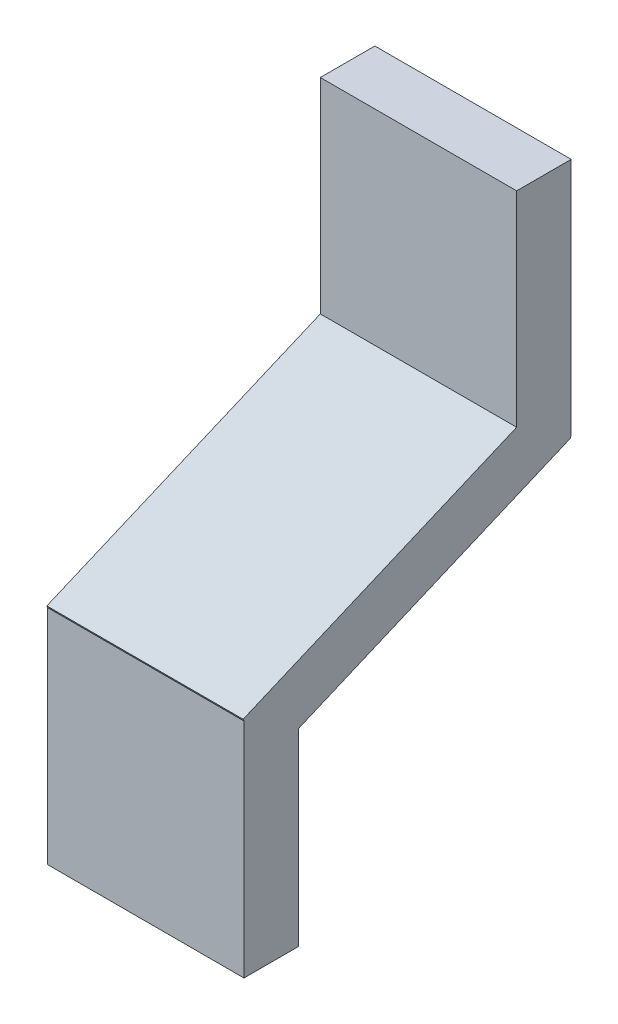
ISO-10303-21;
HEADER;
FILE_DESCRIPTION(('STEP AP214'),'2;1');
FILE_NAME('part.step','',(''),(''),'','','');
FILE_SCHEMA(('AUTOMOTIVE_DESIGN { 1 0 10303 214 1 1 1 1 }'));
ENDSEC;
DATA;
#1=APPLICATION_CONTEXT('core data for automotive mechanical design processes');
#2=APPLICATION_PROTOCOL_DEFINITION('international standard','automotive_design',2000,#1);
#3=PRODUCT_CONTEXT('',#1,'mechanical');
#4=PRODUCT('Part','Part','',(#3));
#5=PRODUCT_RELATED_PRODUCT_CATEGORY('part','',(#4));
#6=PRODUCT_DEFINITION_FORMATION('','',#4);
#7=PRODUCT_DEFINITION_CONTEXT('part definition',#1,'design');
#8=PRODUCT_DEFINITION('design','',#6,#7);
#9=PRODUCT_DEFINITION_SHAPE('','',#8);
#10=(LENGTH_UNIT() NAMED_UNIT(*) SI_UNIT(.MILLI.,.METRE.));
#11=(NAMED_UNIT(*) PLANE_ANGLE_UNIT() SI_UNIT($,.RADIAN.));
#12=(NAMED_UNIT(*) SI_UNIT($,.STERADIAN.) SOLID_ANGLE_UNIT());
#13=UNCERTAINTY_MEASURE_WITH_UNIT(LENGTH_MEASURE(1.E-05),#10,'distance_accuracy_value','');
#14=(GEOMETRIC_REPRESENTATION_CONTEXT(3) GLOBAL_UNCERTAINTY_ASSIGNED_CONTEXT((#13)) GLOBAL_UNIT_ASSIGNED_CONTEXT((#10,
#11,#12)) REPRESENTATION_CONTEXT('',''));
#15=CARTESIAN_POINT('',(0.,0.,0.));
#16=DIRECTION('',(0.,0.,1.));
#17=DIRECTION('',(1.,0.,0.));
#18=AXIS2_PLACEMENT_3D('',#15,#16,#17);
#19=CARTESIAN_POINT('',(8.22,11.,0.5));
#20=DIRECTION('',(0.,0.,1.));
#21=DIRECTION('',(1.,0.,0.));
#22=AXIS2_PLACEMENT_3D('',#19,#20,#21);
#23=PLANE('',#22);
#24=DIRECTION('',(1.,0.,0.));
#25=VECTOR('',#24,1.);
#26=CARTESIAN_POINT('',(8.22,11.3461054439247,0.500000000000314));
#27=LINE('',#26,#25);
#28=CARTESIAN_POINT('',(8.580000014305,11.3461054439242,0.500000000000105));
#29=VERTEX_POINT('',#28);
#30=CARTESIAN_POINT('',(8.22,11.3461054439243,0.500000000000105));
#31=VERTEX_POINT('',#30);
#32=EDGE_CURVE('E148',#29,#31,#27,.F.);
#33=ORIENTED_EDGE('',*,*,#32,.F.);
#34=DIRECTION('',(0.,1.,0.));
#35=VECTOR('',#34,1.);
#36=CARTESIAN_POINT('',(8.580000014305,11.65,0.5));
#37=LINE('',#36,#35);
#38=CARTESIAN_POINT('',(8.580000014305,11.,0.5));
#39=VERTEX_POINT('',#38);
#40=EDGE_CURVE('E154',#39,#29,#37,.T.);
#41=ORIENTED_EDGE('',*,*,#40,.F.);
#42=DIRECTION('',(1.,0.,0.));
#43=VECTOR('',#42,1.);
#44=CARTESIAN_POINT('',(8.22,11.,0.5));
#45=LINE('',#44,#43);
#46=CARTESIAN_POINT('',(8.22,11.,0.5));
#47=VERTEX_POINT('',#46);
#48=EDGE_CURVE('E135',#39,#47,#45,.F.);
#49=ORIENTED_EDGE('',*,*,#48,.T.);
#50=DIRECTION('',(0.,1.,0.));
#51=VECTOR('',#50,1.);
#52=CARTESIAN_POINT('',(8.22,11.65,0.5));
#53=LINE('',#52,#51);
#54=EDGE_CURVE('E182',#47,#31,#53,.T.);
#55=ORIENTED_EDGE('',*,*,#54,.T.);
#56=EDGE_LOOP('',(#33,#41,#49,#55));
#57=FACE_BOUND('',#56,.T.);
#58=ADVANCED_FACE('F17',(#57),#23,.F.);
#59=CARTESIAN_POINT('',(8.22,11.557949520001,0.0009268707435867));
#60=DIRECTION('',(0.,-0.920504786278108,-0.390731286742046));
#61=DIRECTION('',(0.,0.390731286742046,-0.920504786278108));
#62=AXIS2_PLACEMENT_3D('',#59,#60,#61);
#63=PLANE('',#62);
#64=DIRECTION('',(0.,0.39073128674346,-0.920504786277508));
#65=VECTOR('',#64,1.);
#66=CARTESIAN_POINT('',(8.580000014305,11.346105443924,0.5));
#67=LINE('',#66,#65);
#68=CARTESIAN_POINT('',(8.580000014305,11.557949520001,0.000926870743687995));
#69=VERTEX_POINT('',#68);
#70=EDGE_CURVE('E151',#29,#69,#67,.T.);
#71=ORIENTED_EDGE('',*,*,#70,.F.);
#72=ORIENTED_EDGE('',*,*,#32,.T.);
#73=DIRECTION('',(0.,0.39073128674346,-0.920504786277508));
#74=VECTOR('',#73,1.);
#75=CARTESIAN_POINT('',(8.22,11.346105443924,0.5));
#76=LINE('',#75,#74);
#77=CARTESIAN_POINT('',(8.22,11.557949520001,0.000926870743697318));
#78=VERTEX_POINT('',#77);
#79=EDGE_CURVE('E178',#31,#78,#76,.T.);
#80=ORIENTED_EDGE('',*,*,#79,.T.);
#81=DIRECTION('',(1.,0.,0.));
#82=VECTOR('',#81,1.);
#83=CARTESIAN_POINT('',(8.22,11.557949520001,0.000926870743744277));
#84=LINE('',#83,#82);
#85=EDGE_CURVE('E145',#78,#69,#84,.T.);
#86=ORIENTED_EDGE('',*,*,#85,.T.);
#87=EDGE_LOOP('',(#71,#72,#80,#86));
#88=FACE_BOUND('',#87,.T.);
#89=ADVANCED_FACE('F242',(#88),#63,.T.);
#90=CARTESIAN_POINT('',(8.22,11.65,0.04));
#91=DIRECTION('',(0.,-0.390731286742046,0.920504786278108));
#92=DIRECTION('',(0.,-0.920504786278108,-0.390731286742046));
#93=AXIS2_PLACEMENT_3D('',#90,#91,#92);
#94=PLANE('',#93);
#95=DIRECTION('',(0.,0.920504786259231,0.390731286786518));
#96=VECTOR('',#95,1.);
#97=CARTESIAN_POINT('',(8.22,11.557949520001,0.00092687074366));
#98=LINE('',#97,#96);
#99=CARTESIAN_POINT('',(8.22,11.56,0.001797248280528));
#100=VERTEX_POINT('',#99);
#101=EDGE_CURVE('E123',#78,#100,#98,.T.);
#102=ORIENTED_EDGE('',*,*,#101,.T.);
#103=DIRECTION('',(1.,0.,0.));
#104=VECTOR('',#103,1.);
#105=CARTESIAN_POINT('',(8.22,11.56,0.001797248280528));
#106=LINE('',#105,#104);
#107=CARTESIAN_POINT('',(8.580000014305,11.56,0.001797248280528));
#108=VERTEX_POINT('',#107);
#109=EDGE_CURVE('E97',#100,#108,#106,.T.);
#110=ORIENTED_EDGE('',*,*,#109,.T.);
#111=DIRECTION('',(0.,0.920504786259231,0.390731286786518));
#112=VECTOR('',#111,1.);
#113=CARTESIAN_POINT('',(8.580000014305,11.557949520001,0.00092687074366));
#114=LINE('',#113,#112);
#115=EDGE_CURVE('E153',#69,#108,#114,.T.);
#116=ORIENTED_EDGE('',*,*,#115,.F.);
#117=ORIENTED_EDGE('',*,*,#85,.F.);
#118=EDGE_LOOP('',(#102,#110,#116,#117));
#119=FACE_BOUND('',#118,.T.);
#120=ADVANCED_FACE('F243',(#119),#94,.F.);
#121=CARTESIAN_POINT('',(8.22,11.56,0.));
#122=DIRECTION('',(0.,1.,0.));
#123=DIRECTION('',(0.,0.,1.));
#124=AXIS2_PLACEMENT_3D('',#121,#122,#123);
#125=PLANE('',#124);
#126=ORIENTED_EDGE('',*,*,#109,.F.);
#127=DIRECTION('',(0.,0.,1.));
#128=VECTOR('',#127,1.);
#129=CARTESIAN_POINT('',(8.22,11.56,0.));
#130=LINE('',#129,#128);
#131=CARTESIAN_POINT('',(8.22,11.56,0.));
#132=VERTEX_POINT('',#131);
#133=EDGE_CURVE('E20',#100,#132,#130,.F.);
#134=ORIENTED_EDGE('',*,*,#133,.T.);
#135=DIRECTION('',(1.,0.,0.));
#136=VECTOR('',#135,1.);
#137=CARTESIAN_POINT('',(8.22,11.56,0.));
#138=LINE('',#137,#136);
#139=CARTESIAN_POINT('',(8.580000014305,11.56,0.));
#140=VERTEX_POINT('',#139);
#141=EDGE_CURVE('E104',#132,#140,#138,.T.);
#142=ORIENTED_EDGE('',*,*,#141,.T.);
#143=DIRECTION('',(0.,0.,-1.));
#144=VECTOR('',#143,1.);
#145=CARTESIAN_POINT('',(8.580000014305,11.56,0.04));
#146=LINE('',#145,#144);
#147=EDGE_CURVE('E194',#108,#140,#146,.T.);
#148=ORIENTED_EDGE('',*,*,#147,.F.);
#149=EDGE_LOOP('',(#126,#134,#142,#148));
#150=FACE_BOUND('',#149,.T.);
#151=ADVANCED_FACE('F122',(#150),#125,.F.);
#152=CARTESIAN_POINT('',(8.22,11.56,0.));
#153=DIRECTION('',(0.,0.,1.));
#154=DIRECTION('',(1.,0.,0.));
#155=AXIS2_PLACEMENT_3D('',#152,#153,#154);
#156=PLANE('',#155);
#157=ORIENTED_EDGE('',*,*,#141,.F.);
#158=DIRECTION('',(0.,1.,0.));
#159=VECTOR('',#158,1.);
#160=CARTESIAN_POINT('',(8.22,11.65,0.));
#161=LINE('',#160,#159);
#162=CARTESIAN_POINT('',(8.22,11.999999997616,0.));
#163=VERTEX_POINT('',#162);
#164=EDGE_CURVE('E108',#132,#163,#161,.T.);
#165=ORIENTED_EDGE('',*,*,#164,.T.);
#166=DIRECTION('',(1.,0.,0.));
#167=VECTOR('',#166,1.);
#168=CARTESIAN_POINT('',(8.22,11.999999997616,0.));
#169=LINE('',#168,#167);
#170=CARTESIAN_POINT('',(8.580000014305,11.999999997616,0.));
#171=VERTEX_POINT('',#170);
#172=EDGE_CURVE('E110',#171,#163,#169,.F.);
#173=ORIENTED_EDGE('',*,*,#172,.F.);
#174=DIRECTION('',(0.,1.,0.));
#175=VECTOR('',#174,1.);
#176=CARTESIAN_POINT('',(8.580000014305,11.65,0.));
#177=LINE('',#176,#175);
#178=EDGE_CURVE('E109',#140,#171,#177,.T.);
#179=ORIENTED_EDGE('',*,*,#178,.F.);
#180=EDGE_LOOP('',(#157,#165,#173,#179));
#181=FACE_BOUND('',#180,.T.);
#182=ADVANCED_FACE('F106',(#181),#156,.F.);
#183=CARTESIAN_POINT('',(8.22,11.999999997616,0.));
#184=DIRECTION('',(0.,1.,0.));
#185=DIRECTION('',(0.,0.,1.));
#186=AXIS2_PLACEMENT_3D('',#183,#184,#185);
#187=PLANE('',#186);
#188=ORIENTED_EDGE('',*,*,#172,.T.);
#189=DIRECTION('',(0.,0.,-1.));
#190=VECTOR('',#189,1.);
#191=CARTESIAN_POINT('',(8.22,11.999999997616,0.04));
#192=LINE('',#191,#190);
#193=CARTESIAN_POINT('',(8.22,11.999999997616,0.10000000149));
#194=VERTEX_POINT('',#193);
#195=EDGE_CURVE('E120',#163,#194,#192,.F.);
#196=ORIENTED_EDGE('',*,*,#195,.T.);
#197=DIRECTION('',(1.,0.,0.));
#198=VECTOR('',#197,1.);
#199=CARTESIAN_POINT('',(8.22,11.999999997616,0.10000000149));
#200=LINE('',#199,#198);
#201=CARTESIAN_POINT('',(8.580000014305,11.999999997616,0.10000000149));
#202=VERTEX_POINT('',#201);
#203=EDGE_CURVE('E181',#202,#194,#200,.F.);
#204=ORIENTED_EDGE('',*,*,#203,.F.);
#205=DIRECTION('',(0.,0.,-1.));
#206=VECTOR('',#205,1.);
#207=CARTESIAN_POINT('',(8.580000014305,11.999999997616,0.04));
#208=LINE('',#207,#206);
#209=EDGE_CURVE('E140',#171,#202,#208,.F.);
#210=ORIENTED_EDGE('',*,*,#209,.F.);
#211=EDGE_LOOP('',(#188,#196,#204,#210));
#212=FACE_BOUND('',#211,.T.);
#213=ADVANCED_FACE('F271',(#212),#187,.T.);
#214=CARTESIAN_POINT('',(8.22,11.,0.60000000149));
#215=DIRECTION('',(0.,0.,1.));
#216=DIRECTION('',(1.,0.,0.));
#217=AXIS2_PLACEMENT_3D('',#214,#215,#216);
#218=PLANE('',#217);
#219=DIRECTION('',(0.,1.,0.));
#220=VECTOR('',#219,1.);
#221=CARTESIAN_POINT('',(8.580000014305,11.65,0.60000000149));
#222=LINE('',#221,#220);
#223=CARTESIAN_POINT('',(8.580000014305,11.408101447657,0.600000001490072));
#224=VERTEX_POINT('',#223);
#225=CARTESIAN_POINT('',(8.580000014305,11.,0.60000000149));
#226=VERTEX_POINT('',#225);
#227=EDGE_CURVE('E168',#224,#226,#222,.F.);
#228=ORIENTED_EDGE('',*,*,#227,.F.);
#229=DIRECTION('',(1.,0.,0.));
#230=VECTOR('',#229,1.);
#231=CARTESIAN_POINT('',(8.22,11.4081014476569,0.600000001490144));
#232=LINE('',#231,#230);
#233=CARTESIAN_POINT('',(8.22,11.408101447657,0.600000001490072));
#234=VERTEX_POINT('',#233);
#235=EDGE_CURVE('E124',#234,#224,#232,.T.);
#236=ORIENTED_EDGE('',*,*,#235,.F.);
#237=DIRECTION('',(0.,1.,0.));
#238=VECTOR('',#237,1.);
#239=CARTESIAN_POINT('',(8.22,11.65,0.60000000149));
#240=LINE('',#239,#238);
#241=CARTESIAN_POINT('',(8.22,11.,0.60000000149));
#242=VERTEX_POINT('',#241);
#243=EDGE_CURVE('E192',#234,#242,#240,.F.);
#244=ORIENTED_EDGE('',*,*,#243,.T.);
#245=DIRECTION('',(1.,0.,0.));
#246=VECTOR('',#245,1.);
#247=CARTESIAN_POINT('',(8.22,11.,0.60000000149));
#248=LINE('',#247,#246);
#249=EDGE_CURVE('E127',#242,#226,#248,.T.);
#250=ORIENTED_EDGE('',*,*,#249,.T.);
#251=EDGE_LOOP('',(#228,#236,#244,#250));
#252=FACE_BOUND('',#251,.T.);
#253=ADVANCED_FACE('F232',(#252),#218,.T.);
#254=CARTESIAN_POINT('',(8.22,11.,0.5));
#255=DIRECTION('',(0.,1.,0.));
#256=DIRECTION('',(0.,0.,1.));
#257=AXIS2_PLACEMENT_3D('',#254,#255,#256);
#258=PLANE('',#257);
#259=DIRECTION('',(0.,0.,-1.));
#260=VECTOR('',#259,1.);
#261=CARTESIAN_POINT('',(8.22,11.,0.04));
#262=LINE('',#261,#260);
#263=EDGE_CURVE('E187',#242,#47,#262,.T.);
#264=ORIENTED_EDGE('',*,*,#263,.T.);
#265=ORIENTED_EDGE('',*,*,#48,.F.);
#266=DIRECTION('',(0.,0.,-1.));
#267=VECTOR('',#266,1.);
#268=CARTESIAN_POINT('',(8.580000014305,11.,0.04));
#269=LINE('',#268,#267);
#270=EDGE_CURVE('E164',#226,#39,#269,.T.);
#271=ORIENTED_EDGE('',*,*,#270,.F.);
#272=ORIENTED_EDGE('',*,*,#249,.F.);
#273=EDGE_LOOP('',(#264,#265,#271,#272));
#274=FACE_BOUND('',#273,.T.);
#275=ADVANCED_FACE('F235',(#274),#258,.F.);
#276=CARTESIAN_POINT('',(8.22,11.411653909498,0.601507932798));
#277=DIRECTION('',(0.,-0.390731286742046,0.920504786278108));
#278=DIRECTION('',(0.,-0.920504786278108,-0.390731286742046));
#279=AXIS2_PLACEMENT_3D('',#276,#277,#278);
#280=PLANE('',#279);
#281=ORIENTED_EDGE('',*,*,#235,.T.);
#282=DIRECTION('',(0.,-0.920504786262243,-0.390731286779422));
#283=VECTOR('',#282,1.);
#284=CARTESIAN_POINT('',(8.580000014305,11.411653909498,0.601507932798));
#285=LINE('',#284,#283);
#286=CARTESIAN_POINT('',(8.580000014305,11.4116539094979,0.601507932797974));
#287=VERTEX_POINT('',#286);
#288=EDGE_CURVE('E227',#287,#224,#285,.T.);
#289=ORIENTED_EDGE('',*,*,#288,.F.);
#290=DIRECTION('',(1.,0.,0.));
#291=VECTOR('',#290,1.);
#292=CARTESIAN_POINT('',(8.22,11.4116539094978,0.601507932797897));
#293=LINE('',#292,#291);
#294=CARTESIAN_POINT('',(8.22,11.4116539094979,0.601507932797974));
#295=VERTEX_POINT('',#294);
#296=EDGE_CURVE('E167',#287,#295,#293,.F.);
#297=ORIENTED_EDGE('',*,*,#296,.T.);
#298=DIRECTION('',(0.,-0.920504786262243,-0.390731286779422));
#299=VECTOR('',#298,1.);
#300=CARTESIAN_POINT('',(8.22,11.411653909498,0.601507932798));
#301=LINE('',#300,#299);
#302=EDGE_CURVE('E175',#295,#234,#301,.T.);
#303=ORIENTED_EDGE('',*,*,#302,.T.);
#304=EDGE_LOOP('',(#281,#289,#297,#303));
#305=FACE_BOUND('',#304,.T.);
#306=ADVANCED_FACE('F210',(#305),#280,.T.);
#307=CARTESIAN_POINT('',(8.22,11.65,0.04));
#308=DIRECTION('',(1.,0.,0.));
#309=DIRECTION('',(0.,0.,-1.));
#310=AXIS2_PLACEMENT_3D('',#307,#308,#309);
#311=PLANE('',#310);
#312=ORIENTED_EDGE('',*,*,#54,.F.);
#313=ORIENTED_EDGE('',*,*,#263,.F.);
#314=ORIENTED_EDGE('',*,*,#243,.F.);
#315=ORIENTED_EDGE('',*,*,#302,.F.);
#316=DIRECTION('',(0.,0.390731286742046,-0.920504786278108));
#317=VECTOR('',#316,1.);
#318=CARTESIAN_POINT('',(8.22,11.65,0.04));
#319=LINE('',#318,#317);
#320=CARTESIAN_POINT('',(8.22,11.624531498221,0.100000001490019));
#321=VERTEX_POINT('',#320);
#322=EDGE_CURVE('E216',#295,#321,#319,.T.);
#323=ORIENTED_EDGE('',*,*,#322,.T.);
#324=DIRECTION('',(0.,1.,0.));
#325=VECTOR('',#324,1.);
#326=CARTESIAN_POINT('',(8.22,11.56,0.10000000149));
#327=LINE('',#326,#325);
#328=EDGE_CURVE('E161',#194,#321,#327,.F.);
#329=ORIENTED_EDGE('',*,*,#328,.F.);
#330=ORIENTED_EDGE('',*,*,#195,.F.);
#331=ORIENTED_EDGE('',*,*,#164,.F.);
#332=ORIENTED_EDGE('',*,*,#133,.F.);
#333=ORIENTED_EDGE('',*,*,#101,.F.);
#334=ORIENTED_EDGE('',*,*,#79,.F.);
#335=EDGE_LOOP('',(#312,#313,#314,#315,#323,#329,#330,#331,#332,#333,#334));
#336=FACE_BOUND('',#335,.T.);
#337=ADVANCED_FACE('F115',(#336),#311,.F.);
#338=CARTESIAN_POINT('',(8.22,11.56,0.10000000149));
#339=DIRECTION('',(0.,0.,1.));
#340=DIRECTION('',(1.,0.,0.));
#341=AXIS2_PLACEMENT_3D('',#338,#339,#340);
#342=PLANE('',#341);
#343=ORIENTED_EDGE('',*,*,#328,.T.);
#344=DIRECTION('',(1.,0.,0.));
#345=VECTOR('',#344,1.);
#346=CARTESIAN_POINT('',(8.22,11.6245314982212,0.100000001490075));
#347=LINE('',#346,#345);
#348=CARTESIAN_POINT('',(8.580000014305,11.624531498221,0.100000001490019));
#349=VERTEX_POINT('',#348);
#350=EDGE_CURVE('E26',#321,#349,#347,.T.);
#351=ORIENTED_EDGE('',*,*,#350,.T.);
#352=DIRECTION('',(0.,1.,0.));
#353=VECTOR('',#352,1.);
#354=CARTESIAN_POINT('',(8.580000014305,11.65,0.10000000149));
#355=LINE('',#354,#353);
#356=EDGE_CURVE('E34',#202,#349,#355,.F.);
#357=ORIENTED_EDGE('',*,*,#356,.F.);
#358=ORIENTED_EDGE('',*,*,#203,.T.);
#359=EDGE_LOOP('',(#343,#351,#357,#358));
#360=FACE_BOUND('',#359,.T.);
#361=ADVANCED_FACE('F257',(#360),#342,.T.);
#362=CARTESIAN_POINT('',(8.580000014305,11.65,0.04));
#363=DIRECTION('',(1.,0.,0.));
#364=DIRECTION('',(0.,0.,-1.));
#365=AXIS2_PLACEMENT_3D('',#362,#363,#364);
#366=PLANE('',#365);
#367=ORIENTED_EDGE('',*,*,#227,.T.);
#368=ORIENTED_EDGE('',*,*,#270,.T.);
#369=ORIENTED_EDGE('',*,*,#40,.T.);
#370=ORIENTED_EDGE('',*,*,#70,.T.);
#371=ORIENTED_EDGE('',*,*,#115,.T.);
#372=ORIENTED_EDGE('',*,*,#147,.T.);
#373=ORIENTED_EDGE('',*,*,#178,.T.);
#374=ORIENTED_EDGE('',*,*,#209,.T.);
#375=ORIENTED_EDGE('',*,*,#356,.T.);
#376=DIRECTION('',(0.,0.390731286742046,-0.920504786278108));
#377=VECTOR('',#376,1.);
#378=CARTESIAN_POINT('',(8.580000014305,11.65,0.04));
#379=LINE('',#378,#377);
#380=EDGE_CURVE('E11',#349,#287,#379,.F.);
#381=ORIENTED_EDGE('',*,*,#380,.T.);
#382=ORIENTED_EDGE('',*,*,#288,.T.);
#383=EDGE_LOOP('',(#367,#368,#369,#370,#371,#372,#373,#374,#375,#381,#382));
#384=FACE_BOUND('',#383,.T.);
#385=ADVANCED_FACE('F230',(#384),#366,.T.);
#386=CARTESIAN_POINT('',(8.22,11.65,0.04));
#387=DIRECTION('',(0.,-0.920504786278108,-0.390731286742046));
#388=DIRECTION('',(0.,0.390731286742046,-0.920504786278108));
#389=AXIS2_PLACEMENT_3D('',#386,#387,#388);
#390=PLANE('',#389);
#391=ORIENTED_EDGE('',*,*,#350,.F.);
#392=ORIENTED_EDGE('',*,*,#322,.F.);
#393=ORIENTED_EDGE('',*,*,#296,.F.);
#394=ORIENTED_EDGE('',*,*,#380,.F.);
#395=EDGE_LOOP('',(#391,#392,#393,#394));
#396=FACE_BOUND('',#395,.T.);
#397=ADVANCED_FACE('F220',(#396),#390,.F.);
#398=CLOSED_SHELL('',(#58,#89,#120,#151,#182,#213,#253,#275,#306,#337,#361,#385,#397));
#399=MANIFOLD_SOLID_BREP('B1',#398);
#400=ADVANCED_BREP_SHAPE_REPRESENTATION('',(#18,#399),#14);
#401=SHAPE_DEFINITION_REPRESENTATION(#9,#400);
ENDSEC;
END-ISO-10303-21;
